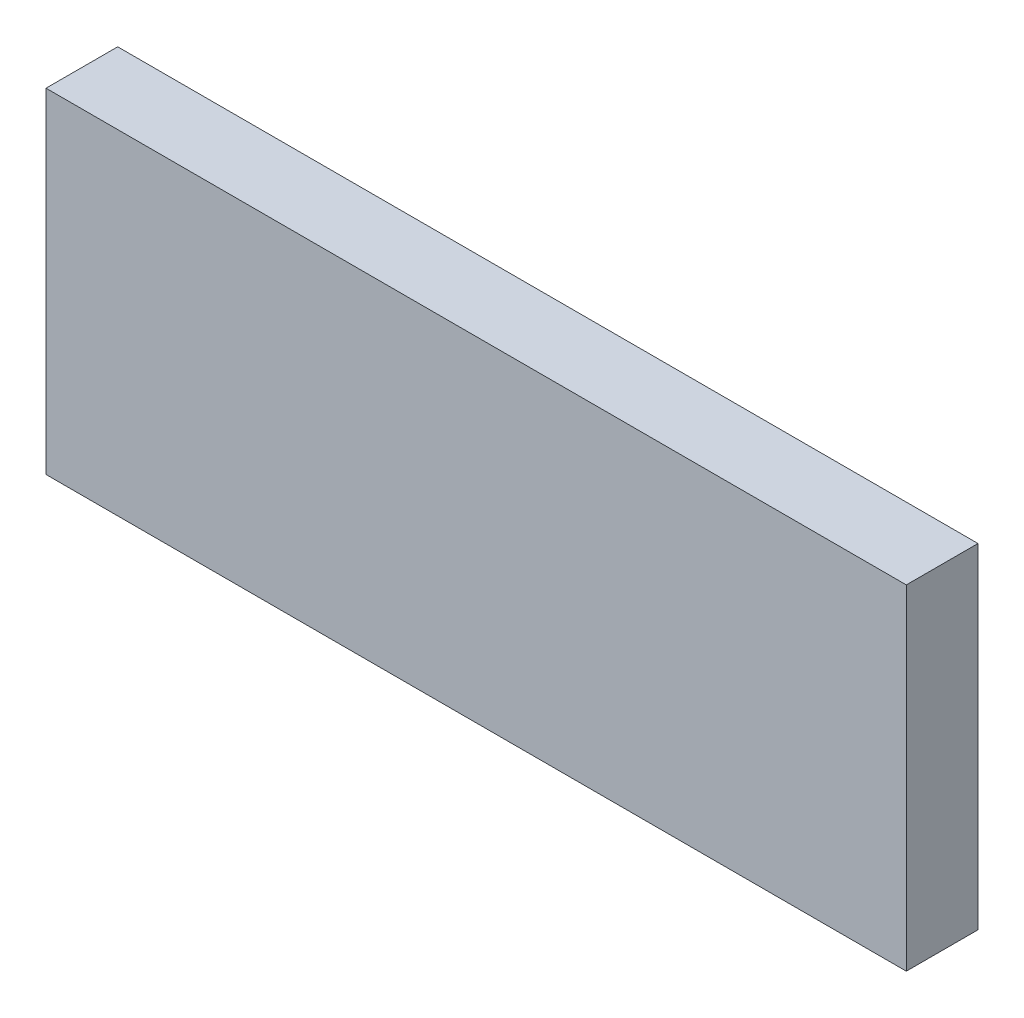
ISO-10303-21;
HEADER;
FILE_DESCRIPTION(('STEP AP214'),'2;1');
FILE_NAME('part.step','',(''),(''),'','','');
FILE_SCHEMA(('AUTOMOTIVE_DESIGN { 1 0 10303 214 1 1 1 1 }'));
ENDSEC;
DATA;
#1=APPLICATION_CONTEXT('core data for automotive mechanical design processes');
#2=APPLICATION_PROTOCOL_DEFINITION('international standard','automotive_design',2000,#1);
#3=PRODUCT_CONTEXT('',#1,'mechanical');
#4=PRODUCT('Part','Part','',(#3));
#5=PRODUCT_RELATED_PRODUCT_CATEGORY('part','',(#4));
#6=PRODUCT_DEFINITION_FORMATION('','',#4);
#7=PRODUCT_DEFINITION_CONTEXT('part definition',#1,'design');
#8=PRODUCT_DEFINITION('design','',#6,#7);
#9=PRODUCT_DEFINITION_SHAPE('','',#8);
#10=(LENGTH_UNIT() NAMED_UNIT(*) SI_UNIT(.MILLI.,.METRE.));
#11=(NAMED_UNIT(*) PLANE_ANGLE_UNIT() SI_UNIT($,.RADIAN.));
#12=(NAMED_UNIT(*) SI_UNIT($,.STERADIAN.) SOLID_ANGLE_UNIT());
#13=UNCERTAINTY_MEASURE_WITH_UNIT(LENGTH_MEASURE(1.E-05),#10,'distance_accuracy_value','');
#14=(GEOMETRIC_REPRESENTATION_CONTEXT(3) GLOBAL_UNCERTAINTY_ASSIGNED_CONTEXT((#13)) GLOBAL_UNIT_ASSIGNED_CONTEXT((#10,
#11,#12)) REPRESENTATION_CONTEXT('',''));
#15=CARTESIAN_POINT('',(0.,0.,0.));
#16=DIRECTION('',(0.,0.,1.));
#17=DIRECTION('',(1.,0.,0.));
#18=AXIS2_PLACEMENT_3D('',#15,#16,#17);
#19=CARTESIAN_POINT('',(0.,0.,0.15));
#20=DIRECTION('',(0.,0.,-1.));
#21=DIRECTION('',(-1.,0.,0.));
#22=AXIS2_PLACEMENT_3D('',#19,#20,#21);
#23=PLANE('',#22);
#24=DIRECTION('',(1.,0.,0.));
#25=VECTOR('',#24,1.);
#26=CARTESIAN_POINT('',(1.95,1.85,0.15));
#27=LINE('',#26,#25);
#28=CARTESIAN_POINT('',(1.95,1.85,0.15));
#29=VERTEX_POINT('',#28);
#30=CARTESIAN_POINT('',(3.75,1.85,0.15));
#31=VERTEX_POINT('',#30);
#32=EDGE_CURVE('E80',#29,#31,#27,.T.);
#33=ORIENTED_EDGE('',*,*,#32,.F.);
#34=DIRECTION('',(0.,1.,0.));
#35=VECTOR('',#34,1.);
#36=CARTESIAN_POINT('',(1.95,1.15,0.15));
#37=LINE('',#36,#35);
#38=CARTESIAN_POINT('',(1.95,1.15,0.15));
#39=VERTEX_POINT('',#38);
#40=EDGE_CURVE('E68',#39,#29,#37,.T.);
#41=ORIENTED_EDGE('',*,*,#40,.F.);
#42=DIRECTION('',(1.,0.,0.));
#43=VECTOR('',#42,1.);
#44=CARTESIAN_POINT('',(3.75,1.15,0.15));
#45=LINE('',#44,#43);
#46=CARTESIAN_POINT('',(3.75,1.15,0.15));
#47=VERTEX_POINT('',#46);
#48=EDGE_CURVE('E55',#47,#39,#45,.F.);
#49=ORIENTED_EDGE('',*,*,#48,.F.);
#50=DIRECTION('',(0.,1.,0.));
#51=VECTOR('',#50,1.);
#52=CARTESIAN_POINT('',(3.75,1.85,0.15));
#53=LINE('',#52,#51);
#54=EDGE_CURVE('E20',#31,#47,#53,.F.);
#55=ORIENTED_EDGE('',*,*,#54,.F.);
#56=EDGE_LOOP('',(#33,#41,#49,#55));
#57=FACE_BOUND('',#56,.T.);
#58=ADVANCED_FACE('F17',(#57),#23,.F.);
#59=CARTESIAN_POINT('',(3.75,1.85,0.15));
#60=DIRECTION('',(1.,0.,0.));
#61=DIRECTION('',(0.,1.,0.));
#62=AXIS2_PLACEMENT_3D('',#59,#60,#61);
#63=PLANE('',#62);
#64=ORIENTED_EDGE('',*,*,#54,.T.);
#65=DIRECTION('',(0.,0.,1.));
#66=VECTOR('',#65,1.);
#67=CARTESIAN_POINT('',(3.75,1.15,0.15));
#68=LINE('',#67,#66);
#69=CARTESIAN_POINT('',(3.75,1.15,0.));
#70=VERTEX_POINT('',#69);
#71=EDGE_CURVE('E61',#70,#47,#68,.T.);
#72=ORIENTED_EDGE('',*,*,#71,.F.);
#73=DIRECTION('',(0.,1.,0.));
#74=VECTOR('',#73,1.);
#75=CARTESIAN_POINT('',(3.75,0.,0.));
#76=LINE('',#75,#74);
#77=CARTESIAN_POINT('',(3.75,1.85,0.));
#78=VERTEX_POINT('',#77);
#79=EDGE_CURVE('E83',#78,#70,#76,.F.);
#80=ORIENTED_EDGE('',*,*,#79,.F.);
#81=DIRECTION('',(0.,0.,1.));
#82=VECTOR('',#81,1.);
#83=CARTESIAN_POINT('',(3.75,1.85,0.15));
#84=LINE('',#83,#82);
#85=EDGE_CURVE('E64',#31,#78,#84,.F.);
#86=ORIENTED_EDGE('',*,*,#85,.F.);
#87=EDGE_LOOP('',(#64,#72,#80,#86));
#88=FACE_BOUND('',#87,.T.);
#89=ADVANCED_FACE('F60',(#88),#63,.T.);
#90=CARTESIAN_POINT('',(3.75,1.15,0.15));
#91=DIRECTION('',(0.,-1.,0.));
#92=DIRECTION('',(1.,0.,0.));
#93=AXIS2_PLACEMENT_3D('',#90,#91,#92);
#94=PLANE('',#93);
#95=ORIENTED_EDGE('',*,*,#48,.T.);
#96=DIRECTION('',(0.,0.,1.));
#97=VECTOR('',#96,1.);
#98=CARTESIAN_POINT('',(1.95,1.15,0.15));
#99=LINE('',#98,#97);
#100=CARTESIAN_POINT('',(1.95,1.15,0.));
#101=VERTEX_POINT('',#100);
#102=EDGE_CURVE('E70',#101,#39,#99,.T.);
#103=ORIENTED_EDGE('',*,*,#102,.F.);
#104=DIRECTION('',(-1.,0.,0.));
#105=VECTOR('',#104,1.);
#106=CARTESIAN_POINT('',(0.,1.15,0.));
#107=LINE('',#106,#105);
#108=EDGE_CURVE('E74',#70,#101,#107,.T.);
#109=ORIENTED_EDGE('',*,*,#108,.F.);
#110=ORIENTED_EDGE('',*,*,#71,.T.);
#111=EDGE_LOOP('',(#95,#103,#109,#110));
#112=FACE_BOUND('',#111,.T.);
#113=ADVANCED_FACE('F72',(#112),#94,.T.);
#114=CARTESIAN_POINT('',(1.95,1.15,0.15));
#115=DIRECTION('',(-1.,0.,0.));
#116=DIRECTION('',(0.,0.,1.));
#117=AXIS2_PLACEMENT_3D('',#114,#115,#116);
#118=PLANE('',#117);
#119=ORIENTED_EDGE('',*,*,#40,.T.);
#120=DIRECTION('',(0.,0.,1.));
#121=VECTOR('',#120,1.);
#122=CARTESIAN_POINT('',(1.95,1.85,0.15));
#123=LINE('',#122,#121);
#124=CARTESIAN_POINT('',(1.95,1.85,0.));
#125=VERTEX_POINT('',#124);
#126=EDGE_CURVE('E35',#125,#29,#123,.T.);
#127=ORIENTED_EDGE('',*,*,#126,.F.);
#128=DIRECTION('',(0.,1.,0.));
#129=VECTOR('',#128,1.);
#130=CARTESIAN_POINT('',(1.95,0.,0.));
#131=LINE('',#130,#129);
#132=EDGE_CURVE('E26',#101,#125,#131,.T.);
#133=ORIENTED_EDGE('',*,*,#132,.F.);
#134=ORIENTED_EDGE('',*,*,#102,.T.);
#135=EDGE_LOOP('',(#119,#127,#133,#134));
#136=FACE_BOUND('',#135,.T.);
#137=ADVANCED_FACE('F89',(#136),#118,.T.);
#138=CARTESIAN_POINT('',(1.95,1.85,0.15));
#139=DIRECTION('',(0.,1.,0.));
#140=DIRECTION('',(0.,0.,1.));
#141=AXIS2_PLACEMENT_3D('',#138,#139,#140);
#142=PLANE('',#141);
#143=ORIENTED_EDGE('',*,*,#32,.T.);
#144=ORIENTED_EDGE('',*,*,#85,.T.);
#145=DIRECTION('',(-1.,0.,0.));
#146=VECTOR('',#145,1.);
#147=CARTESIAN_POINT('',(0.,1.85,0.));
#148=LINE('',#147,#146);
#149=EDGE_CURVE('E11',#125,#78,#148,.F.);
#150=ORIENTED_EDGE('',*,*,#149,.F.);
#151=ORIENTED_EDGE('',*,*,#126,.T.);
#152=EDGE_LOOP('',(#143,#144,#150,#151));
#153=FACE_BOUND('',#152,.T.);
#154=ADVANCED_FACE('F91',(#153),#142,.T.);
#155=CARTESIAN_POINT('',(0.,0.,0.));
#156=DIRECTION('',(0.,0.,-1.));
#157=DIRECTION('',(-1.,0.,0.));
#158=AXIS2_PLACEMENT_3D('',#155,#156,#157);
#159=PLANE('',#158);
#160=ORIENTED_EDGE('',*,*,#132,.T.);
#161=ORIENTED_EDGE('',*,*,#149,.T.);
#162=ORIENTED_EDGE('',*,*,#79,.T.);
#163=ORIENTED_EDGE('',*,*,#108,.T.);
#164=EDGE_LOOP('',(#160,#161,#162,#163));
#165=FACE_BOUND('',#164,.T.);
#166=ADVANCED_FACE('F88',(#165),#159,.T.);
#167=CLOSED_SHELL('',(#58,#89,#113,#137,#154,#166));
#168=MANIFOLD_SOLID_BREP('B1',#167);
#169=ADVANCED_BREP_SHAPE_REPRESENTATION('',(#18,#168),#14);
#170=SHAPE_DEFINITION_REPRESENTATION(#9,#169);
ENDSEC;
END-ISO-10303-21;
